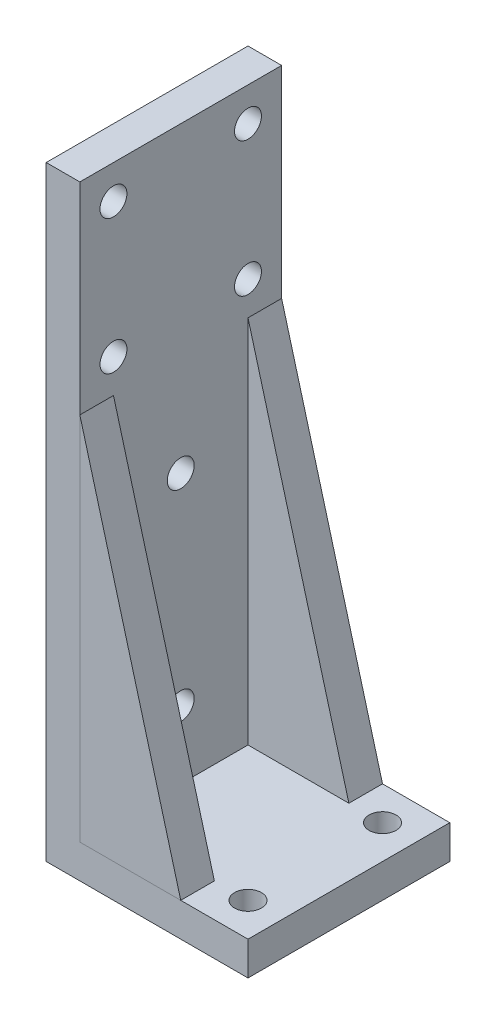
ISO-10303-21;
HEADER;
FILE_DESCRIPTION(('STEP AP214'),'2;1');
FILE_NAME('part.step','',(''),(''),'','','');
FILE_SCHEMA(('AUTOMOTIVE_DESIGN { 1 0 10303 214 1 1 1 1 }'));
ENDSEC;
DATA;
#1=APPLICATION_CONTEXT('core data for automotive mechanical design processes');
#2=APPLICATION_PROTOCOL_DEFINITION('international standard','automotive_design',2000,#1);
#3=PRODUCT_CONTEXT('',#1,'mechanical');
#4=PRODUCT('Part','Part','',(#3));
#5=PRODUCT_RELATED_PRODUCT_CATEGORY('part','',(#4));
#6=PRODUCT_DEFINITION_FORMATION('','',#4);
#7=PRODUCT_DEFINITION_CONTEXT('part definition',#1,'design');
#8=PRODUCT_DEFINITION('design','',#6,#7);
#9=PRODUCT_DEFINITION_SHAPE('','',#8);
#10=(LENGTH_UNIT() NAMED_UNIT(*) SI_UNIT(.MILLI.,.METRE.));
#11=(NAMED_UNIT(*) PLANE_ANGLE_UNIT() SI_UNIT($,.RADIAN.));
#12=(NAMED_UNIT(*) SI_UNIT($,.STERADIAN.) SOLID_ANGLE_UNIT());
#13=UNCERTAINTY_MEASURE_WITH_UNIT(LENGTH_MEASURE(1.E-05),#10,'distance_accuracy_value','');
#14=(GEOMETRIC_REPRESENTATION_CONTEXT(3) GLOBAL_UNCERTAINTY_ASSIGNED_CONTEXT((#13)) GLOBAL_UNIT_ASSIGNED_CONTEXT((#10,
#11,#12)) REPRESENTATION_CONTEXT('',''));
#15=CARTESIAN_POINT('',(0.,0.,0.));
#16=DIRECTION('',(0.,0.,1.));
#17=DIRECTION('',(1.,0.,0.));
#18=AXIS2_PLACEMENT_3D('',#15,#16,#17);
#19=CARTESIAN_POINT('',(5.00000000000001,5.,10.));
#20=DIRECTION('',(0.,-1.,0.));
#21=DIRECTION('',(0.,0.,-1.));
#22=AXIS2_PLACEMENT_3D('',#19,#20,#21);
#23=PLANE('',#22);
#24=DIRECTION('',(1.,0.,0.));
#25=VECTOR('',#24,1.);
#26=CARTESIAN_POINT('',(5.00000000000001,5.,15.));
#27=LINE('',#26,#25);
#28=CARTESIAN_POINT('',(-9.99999999999999,5.,15.));
#29=VERTEX_POINT('',#28);
#30=CARTESIAN_POINT('',(5.00000000000001,5.,15.));
#31=VERTEX_POINT('',#30);
#32=EDGE_CURVE('E94',#29,#31,#27,.T.);
#33=ORIENTED_EDGE('',*,*,#32,.F.);
#34=DIRECTION('',(0.,0.,1.));
#35=VECTOR('',#34,1.);
#36=CARTESIAN_POINT('',(-9.99999999999999,5.,10.));
#37=LINE('',#36,#35);
#38=CARTESIAN_POINT('',(-9.99999999999999,5.,10.));
#39=VERTEX_POINT('',#38);
#40=EDGE_CURVE('E12',#39,#29,#37,.T.);
#41=ORIENTED_EDGE('',*,*,#40,.F.);
#42=DIRECTION('',(1.,0.,0.));
#43=VECTOR('',#42,1.);
#44=CARTESIAN_POINT('',(5.00000000000001,5.,10.));
#45=LINE('',#44,#43);
#46=CARTESIAN_POINT('',(5.00000000000001,5.,10.));
#47=VERTEX_POINT('',#46);
#48=EDGE_CURVE('E86',#39,#47,#45,.T.);
#49=ORIENTED_EDGE('',*,*,#48,.T.);
#50=DIRECTION('',(0.,0.,1.));
#51=VECTOR('',#50,1.);
#52=CARTESIAN_POINT('',(5.00000000000001,5.,10.));
#53=LINE('',#52,#51);
#54=EDGE_CURVE('E45',#47,#31,#53,.T.);
#55=ORIENTED_EDGE('',*,*,#54,.T.);
#56=EDGE_LOOP('',(#33,#41,#49,#55));
#57=FACE_BOUND('',#56,.T.);
#58=ADVANCED_FACE('F42',(#57),#23,.T.);
#59=CARTESIAN_POINT('',(-9.99999999999999,5.,10.));
#60=DIRECTION('',(-1.,0.,0.));
#61=DIRECTION('',(0.,-1.,0.));
#62=AXIS2_PLACEMENT_3D('',#59,#60,#61);
#63=PLANE('',#62);
#64=DIRECTION('',(0.,-1.,0.));
#65=VECTOR('',#64,1.);
#66=CARTESIAN_POINT('',(-9.99999999999999,5.,15.));
#67=LINE('',#66,#65);
#68=CARTESIAN_POINT('',(-10.,60.,15.));
#69=VERTEX_POINT('',#68);
#70=EDGE_CURVE('E88',#69,#29,#67,.T.);
#71=ORIENTED_EDGE('',*,*,#70,.F.);
#72=DIRECTION('',(0.,0.,1.));
#73=VECTOR('',#72,1.);
#74=CARTESIAN_POINT('',(-10.,60.,10.));
#75=LINE('',#74,#73);
#76=CARTESIAN_POINT('',(-10.,60.,10.));
#77=VERTEX_POINT('',#76);
#78=EDGE_CURVE('E51',#77,#69,#75,.T.);
#79=ORIENTED_EDGE('',*,*,#78,.F.);
#80=DIRECTION('',(0.,-1.,0.));
#81=VECTOR('',#80,1.);
#82=CARTESIAN_POINT('',(-9.99999999999999,5.,10.));
#83=LINE('',#82,#81);
#84=EDGE_CURVE('E83',#77,#39,#83,.T.);
#85=ORIENTED_EDGE('',*,*,#84,.T.);
#86=ORIENTED_EDGE('',*,*,#40,.T.);
#87=EDGE_LOOP('',(#71,#79,#85,#86));
#88=FACE_BOUND('',#87,.T.);
#89=ADVANCED_FACE('F98',(#88),#63,.T.);
#90=CARTESIAN_POINT('',(-10.,60.,10.));
#91=DIRECTION('',(0.964763821237732,0.263117405792109,0.));
#92=DIRECTION('',(-0.263117405792109,0.964763821237732,0.));
#93=AXIS2_PLACEMENT_3D('',#90,#91,#92);
#94=PLANE('',#93);
#95=DIRECTION('',(-0.263117405792109,0.964763821237732,0.));
#96=VECTOR('',#95,1.);
#97=CARTESIAN_POINT('',(-10.,60.,15.));
#98=LINE('',#97,#96);
#99=EDGE_CURVE('E81',#31,#69,#98,.T.);
#100=ORIENTED_EDGE('',*,*,#99,.F.);
#101=ORIENTED_EDGE('',*,*,#54,.F.);
#102=DIRECTION('',(-0.263117405792109,0.964763821237732,0.));
#103=VECTOR('',#102,1.);
#104=CARTESIAN_POINT('',(-10.,60.,10.));
#105=LINE('',#104,#103);
#106=EDGE_CURVE('E79',#47,#77,#105,.T.);
#107=ORIENTED_EDGE('',*,*,#106,.T.);
#108=ORIENTED_EDGE('',*,*,#78,.T.);
#109=EDGE_LOOP('',(#100,#101,#107,#108));
#110=FACE_BOUND('',#109,.T.);
#111=ADVANCED_FACE('F78',(#110),#94,.T.);
#112=CARTESIAN_POINT('',(0.,0.,10.));
#113=DIRECTION('',(0.,0.,-1.));
#114=DIRECTION('',(-1.,0.,0.));
#115=AXIS2_PLACEMENT_3D('',#112,#113,#114);
#116=PLANE('',#115);
#117=ORIENTED_EDGE('',*,*,#48,.F.);
#118=ORIENTED_EDGE('',*,*,#84,.F.);
#119=ORIENTED_EDGE('',*,*,#106,.F.);
#120=EDGE_LOOP('',(#117,#118,#119));
#121=FACE_BOUND('',#120,.T.);
#122=ADVANCED_FACE('F85',(#121),#116,.T.);
#123=CARTESIAN_POINT('',(0.,0.,15.));
#124=DIRECTION('',(0.,0.,-1.));
#125=DIRECTION('',(-1.,0.,0.));
#126=AXIS2_PLACEMENT_3D('',#123,#124,#125);
#127=PLANE('',#126);
#128=ORIENTED_EDGE('',*,*,#32,.T.);
#129=ORIENTED_EDGE('',*,*,#99,.T.);
#130=ORIENTED_EDGE('',*,*,#70,.T.);
#131=EDGE_LOOP('',(#128,#129,#130));
#132=FACE_BOUND('',#131,.T.);
#133=ADVANCED_FACE('F97',(#132),#127,.F.);
#134=CLOSED_SHELL('',(#58,#89,#111,#122,#133));
#135=MANIFOLD_SOLID_BREP('B2',#134);
#136=CARTESIAN_POINT('',(0.,5.,0.));
#137=DIRECTION('',(0.,-1.,0.));
#138=DIRECTION('',(0.,0.,-1.));
#139=AXIS2_PLACEMENT_3D('',#136,#137,#138);
#140=PLANE('',#139);
#141=CARTESIAN_POINT('',(10.,5.,10.));
#142=DIRECTION('',(0.,1.,0.));
#143=DIRECTION('',(0.,0.,1.));
#144=AXIS2_PLACEMENT_3D('',#141,#142,#143);
#145=CIRCLE('',#144,2.);
#146=CARTESIAN_POINT('',(10.,5.,12.));
#147=VERTEX_POINT('',#146);
#148=EDGE_CURVE('E318',#147,#147,#145,.T.);
#149=ORIENTED_EDGE('',*,*,#148,.F.);
#150=EDGE_LOOP('',(#149));
#151=FACE_BOUND('',#150,.T.);
#152=CARTESIAN_POINT('',(10.,5.,-10.));
#153=DIRECTION('',(0.,1.,0.));
#154=DIRECTION('',(0.,0.,1.));
#155=AXIS2_PLACEMENT_3D('',#152,#153,#154);
#156=CIRCLE('',#155,2.);
#157=CARTESIAN_POINT('',(10.,5.,-8.));
#158=VERTEX_POINT('',#157);
#159=EDGE_CURVE('E312',#158,#158,#156,.T.);
#160=ORIENTED_EDGE('',*,*,#159,.F.);
#161=EDGE_LOOP('',(#160));
#162=FACE_BOUND('',#161,.T.);
#163=DIRECTION('',(0.,0.,-1.));
#164=VECTOR('',#163,1.);
#165=CARTESIAN_POINT('',(5.00000000000001,5.,-10.));
#166=LINE('',#165,#164);
#167=CARTESIAN_POINT('',(5.00000000000001,5.,-10.));
#168=VERTEX_POINT('',#167);
#169=CARTESIAN_POINT('',(5.00000000000001,5.,-15.));
#170=VERTEX_POINT('',#169);
#171=EDGE_CURVE('E239',#168,#170,#166,.T.);
#172=ORIENTED_EDGE('',*,*,#171,.F.);
#173=DIRECTION('',(1.,0.,0.));
#174=VECTOR('',#173,1.);
#175=CARTESIAN_POINT('',(5.00000000000001,5.,-10.));
#176=LINE('',#175,#174);
#177=CARTESIAN_POINT('',(-9.99999999999999,5.,-10.));
#178=VERTEX_POINT('',#177);
#179=EDGE_CURVE('E254',#178,#168,#176,.T.);
#180=ORIENTED_EDGE('',*,*,#179,.F.);
#181=DIRECTION('',(0.,0.,-1.));
#182=VECTOR('',#181,1.);
#183=CARTESIAN_POINT('',(-9.99999999999999,5.,-15.));
#184=LINE('',#183,#182);
#185=CARTESIAN_POINT('',(-9.99999999999999,5.,15.));
#186=VERTEX_POINT('',#185);
#187=EDGE_CURVE('E154',#186,#178,#184,.T.);
#188=ORIENTED_EDGE('',*,*,#187,.F.);
#189=DIRECTION('',(1.,0.,0.));
#190=VECTOR('',#189,1.);
#191=CARTESIAN_POINT('',(-15.,5.,15.));
#192=LINE('',#191,#190);
#193=CARTESIAN_POINT('',(15.,5.,15.));
#194=VERTEX_POINT('',#193);
#195=EDGE_CURVE('E159',#186,#194,#192,.T.);
#196=ORIENTED_EDGE('',*,*,#195,.T.);
#197=DIRECTION('',(0.,0.,-1.));
#198=VECTOR('',#197,1.);
#199=CARTESIAN_POINT('',(15.,5.,15.));
#200=LINE('',#199,#198);
#201=CARTESIAN_POINT('',(15.,5.,-15.));
#202=VERTEX_POINT('',#201);
#203=EDGE_CURVE('E190',#194,#202,#200,.T.);
#204=ORIENTED_EDGE('',*,*,#203,.T.);
#205=DIRECTION('',(-1.,0.,0.));
#206=VECTOR('',#205,1.);
#207=CARTESIAN_POINT('',(-15.,5.,-15.));
#208=LINE('',#207,#206);
#209=EDGE_CURVE('E241',#202,#170,#208,.T.);
#210=ORIENTED_EDGE('',*,*,#209,.T.);
#211=EDGE_LOOP('',(#172,#180,#188,#196,#204,#210));
#212=FACE_BOUND('',#211,.T.);
#213=ADVANCED_FACE('F139',(#151,#162,#212),#140,.F.);
#214=CARTESIAN_POINT('',(-9.99999999999999,90.,-15.));
#215=DIRECTION('',(-1.,0.,0.));
#216=DIRECTION('',(0.,0.,1.));
#217=AXIS2_PLACEMENT_3D('',#214,#215,#216);
#218=PLANE('',#217);
#219=CARTESIAN_POINT('',(-9.99999999999999,65.,-10.));
#220=DIRECTION('',(1.,0.,0.));
#221=DIRECTION('',(0.,0.,-1.));
#222=AXIS2_PLACEMENT_3D('',#219,#220,#221);
#223=CIRCLE('',#222,2.);
#224=CARTESIAN_POINT('',(-9.99999999999999,65.,-12.));
#225=VERTEX_POINT('',#224);
#226=EDGE_CURVE('E330',#225,#225,#223,.T.);
#227=ORIENTED_EDGE('',*,*,#226,.F.);
#228=EDGE_LOOP('',(#227));
#229=FACE_BOUND('',#228,.T.);
#230=CARTESIAN_POINT('',(-9.99999999999999,65.,10.));
#231=DIRECTION('',(1.,0.,0.));
#232=DIRECTION('',(0.,0.,-1.));
#233=AXIS2_PLACEMENT_3D('',#230,#231,#232);
#234=CIRCLE('',#233,2.);
#235=CARTESIAN_POINT('',(-9.99999999999999,65.,8.));
#236=VERTEX_POINT('',#235);
#237=EDGE_CURVE('E324',#236,#236,#234,.T.);
#238=ORIENTED_EDGE('',*,*,#237,.F.);
#239=EDGE_LOOP('',(#238));
#240=FACE_BOUND('',#239,.T.);
#241=CARTESIAN_POINT('',(-9.99999999999999,85.,-10.));
#242=DIRECTION('',(1.,0.,0.));
#243=DIRECTION('',(0.,0.,-1.));
#244=AXIS2_PLACEMENT_3D('',#241,#242,#243);
#245=CIRCLE('',#244,2.);
#246=CARTESIAN_POINT('',(-9.99999999999999,85.,-12.));
#247=VERTEX_POINT('',#246);
#248=EDGE_CURVE('E307',#247,#247,#245,.T.);
#249=ORIENTED_EDGE('',*,*,#248,.F.);
#250=EDGE_LOOP('',(#249));
#251=FACE_BOUND('',#250,.T.);
#252=CARTESIAN_POINT('',(-9.99999999999999,15.,0.));
#253=DIRECTION('',(1.,0.,0.));
#254=DIRECTION('',(0.,0.,-1.));
#255=AXIS2_PLACEMENT_3D('',#252,#253,#254);
#256=CIRCLE('',#255,2.);
#257=CARTESIAN_POINT('',(-9.99999999999999,15.,-2.));
#258=VERTEX_POINT('',#257);
#259=EDGE_CURVE('E301',#258,#258,#256,.T.);
#260=ORIENTED_EDGE('',*,*,#259,.F.);
#261=EDGE_LOOP('',(#260));
#262=FACE_BOUND('',#261,.T.);
#263=CARTESIAN_POINT('',(-9.99999999999999,45.,0.));
#264=DIRECTION('',(1.,0.,0.));
#265=DIRECTION('',(0.,0.,-1.));
#266=AXIS2_PLACEMENT_3D('',#263,#264,#265);
#267=CIRCLE('',#266,2.);
#268=CARTESIAN_POINT('',(-9.99999999999999,45.,-2.));
#269=VERTEX_POINT('',#268);
#270=EDGE_CURVE('E294',#269,#269,#267,.T.);
#271=ORIENTED_EDGE('',*,*,#270,.F.);
#272=EDGE_LOOP('',(#271));
#273=FACE_BOUND('',#272,.T.);
#274=CARTESIAN_POINT('',(-9.99999999999999,85.,10.));
#275=DIRECTION('',(1.,0.,0.));
#276=DIRECTION('',(0.,0.,-1.));
#277=AXIS2_PLACEMENT_3D('',#274,#275,#276);
#278=CIRCLE('',#277,2.);
#279=CARTESIAN_POINT('',(-9.99999999999999,85.,8.));
#280=VERTEX_POINT('',#279);
#281=EDGE_CURVE('E288',#280,#280,#278,.T.);
#282=ORIENTED_EDGE('',*,*,#281,.F.);
#283=EDGE_LOOP('',(#282));
#284=FACE_BOUND('',#283,.T.);
#285=DIRECTION('',(0.,0.,-1.));
#286=VECTOR('',#285,1.);
#287=CARTESIAN_POINT('',(-9.99999999999999,60.,-10.));
#288=LINE('',#287,#286);
#289=CARTESIAN_POINT('',(-9.99999999999999,60.,-10.));
#290=VERTEX_POINT('',#289);
#291=CARTESIAN_POINT('',(-9.99999999999999,60.,-15.));
#292=VERTEX_POINT('',#291);
#293=EDGE_CURVE('E262',#290,#292,#288,.T.);
#294=ORIENTED_EDGE('',*,*,#293,.T.);
#295=DIRECTION('',(0.,-1.,0.));
#296=VECTOR('',#295,1.);
#297=CARTESIAN_POINT('',(-9.99999999999999,90.,-15.));
#298=LINE('',#297,#296);
#299=CARTESIAN_POINT('',(-9.99999999999999,90.,-15.));
#300=VERTEX_POINT('',#299);
#301=EDGE_CURVE('E204',#300,#292,#298,.T.);
#302=ORIENTED_EDGE('',*,*,#301,.F.);
#303=DIRECTION('',(0.,0.,-1.));
#304=VECTOR('',#303,1.);
#305=CARTESIAN_POINT('',(-9.99999999999999,90.,-15.));
#306=LINE('',#305,#304);
#307=CARTESIAN_POINT('',(-9.99999999999999,90.,15.));
#308=VERTEX_POINT('',#307);
#309=EDGE_CURVE('E231',#308,#300,#306,.T.);
#310=ORIENTED_EDGE('',*,*,#309,.F.);
#311=DIRECTION('',(0.,-1.,0.));
#312=VECTOR('',#311,1.);
#313=CARTESIAN_POINT('',(-9.99999999999999,90.,15.));
#314=LINE('',#313,#312);
#315=EDGE_CURVE('E200',#308,#186,#314,.T.);
#316=ORIENTED_EDGE('',*,*,#315,.T.);
#317=ORIENTED_EDGE('',*,*,#187,.T.);
#318=DIRECTION('',(0.,-1.,0.));
#319=VECTOR('',#318,1.);
#320=CARTESIAN_POINT('',(-9.99999999999999,5.,-10.));
#321=LINE('',#320,#319);
#322=EDGE_CURVE('E264',#290,#178,#321,.T.);
#323=ORIENTED_EDGE('',*,*,#322,.F.);
#324=EDGE_LOOP('',(#294,#302,#310,#316,#317,#323));
#325=FACE_BOUND('',#324,.T.);
#326=ADVANCED_FACE('F271',(#229,#240,#251,#262,#273,#284,#325),#218,.F.);
#327=CARTESIAN_POINT('',(15.,5.,15.));
#328=DIRECTION('',(-1.,0.,0.));
#329=DIRECTION('',(0.,0.,1.));
#330=AXIS2_PLACEMENT_3D('',#327,#328,#329);
#331=PLANE('',#330);
#332=DIRECTION('',(0.,0.,-1.));
#333=VECTOR('',#332,1.);
#334=CARTESIAN_POINT('',(15.,0.,15.));
#335=LINE('',#334,#333);
#336=CARTESIAN_POINT('',(15.,0.,15.));
#337=VERTEX_POINT('',#336);
#338=CARTESIAN_POINT('',(15.,0.,-15.));
#339=VERTEX_POINT('',#338);
#340=EDGE_CURVE('E196',#337,#339,#335,.T.);
#341=ORIENTED_EDGE('',*,*,#340,.T.);
#342=DIRECTION('',(0.,-1.,0.));
#343=VECTOR('',#342,1.);
#344=CARTESIAN_POINT('',(15.,5.,-15.));
#345=LINE('',#344,#343);
#346=EDGE_CURVE('E40',#202,#339,#345,.T.);
#347=ORIENTED_EDGE('',*,*,#346,.F.);
#348=ORIENTED_EDGE('',*,*,#203,.F.);
#349=DIRECTION('',(0.,-1.,0.));
#350=VECTOR('',#349,1.);
#351=CARTESIAN_POINT('',(15.,5.,15.));
#352=LINE('',#351,#350);
#353=EDGE_CURVE('E182',#194,#337,#352,.T.);
#354=ORIENTED_EDGE('',*,*,#353,.T.);
#355=EDGE_LOOP('',(#341,#347,#348,#354));
#356=FACE_BOUND('',#355,.T.);
#357=ADVANCED_FACE('F141',(#356),#331,.F.);
#358=CARTESIAN_POINT('',(-15.,5.,-15.));
#359=DIRECTION('',(0.,0.,1.));
#360=DIRECTION('',(1.,0.,0.));
#361=AXIS2_PLACEMENT_3D('',#358,#359,#360);
#362=PLANE('',#361);
#363=DIRECTION('',(-0.263117405792109,0.964763821237732,0.));
#364=VECTOR('',#363,1.);
#365=CARTESIAN_POINT('',(-9.99999999999999,60.,-15.));
#366=LINE('',#365,#364);
#367=EDGE_CURVE('E250',#170,#292,#366,.T.);
#368=ORIENTED_EDGE('',*,*,#367,.F.);
#369=ORIENTED_EDGE('',*,*,#209,.F.);
#370=ORIENTED_EDGE('',*,*,#346,.T.);
#371=DIRECTION('',(-1.,0.,0.));
#372=VECTOR('',#371,1.);
#373=CARTESIAN_POINT('',(-15.,0.,-15.));
#374=LINE('',#373,#372);
#375=CARTESIAN_POINT('',(-15.,0.,-15.));
#376=VERTEX_POINT('',#375);
#377=EDGE_CURVE('E199',#339,#376,#374,.T.);
#378=ORIENTED_EDGE('',*,*,#377,.T.);
#379=DIRECTION('',(0.,-1.,0.));
#380=VECTOR('',#379,1.);
#381=CARTESIAN_POINT('',(-15.,5.,-15.));
#382=LINE('',#381,#380);
#383=CARTESIAN_POINT('',(-15.,90.,-15.));
#384=VERTEX_POINT('',#383);
#385=EDGE_CURVE('E147',#384,#376,#382,.T.);
#386=ORIENTED_EDGE('',*,*,#385,.F.);
#387=DIRECTION('',(-1.,0.,0.));
#388=VECTOR('',#387,1.);
#389=CARTESIAN_POINT('',(-15.,90.,-15.));
#390=LINE('',#389,#388);
#391=EDGE_CURVE('E224',#300,#384,#390,.T.);
#392=ORIENTED_EDGE('',*,*,#391,.F.);
#393=ORIENTED_EDGE('',*,*,#301,.T.);
#394=EDGE_LOOP('',(#368,#369,#370,#378,#386,#392,#393));
#395=FACE_BOUND('',#394,.T.);
#396=ADVANCED_FACE('F221',(#395),#362,.F.);
#397=CARTESIAN_POINT('',(-15.,5.,15.));
#398=DIRECTION('',(1.,0.,0.));
#399=DIRECTION('',(0.,0.,-1.));
#400=AXIS2_PLACEMENT_3D('',#397,#398,#399);
#401=PLANE('',#400);
#402=CARTESIAN_POINT('',(-15.,65.,-10.));
#403=DIRECTION('',(1.,0.,0.));
#404=DIRECTION('',(0.,0.,-1.));
#405=AXIS2_PLACEMENT_3D('',#402,#403,#404);
#406=CIRCLE('',#405,2.);
#407=CARTESIAN_POINT('',(-15.,65.,-12.));
#408=VERTEX_POINT('',#407);
#409=EDGE_CURVE('E327',#408,#408,#406,.T.);
#410=ORIENTED_EDGE('',*,*,#409,.T.);
#411=EDGE_LOOP('',(#410));
#412=FACE_BOUND('',#411,.T.);
#413=CARTESIAN_POINT('',(-15.,65.,10.));
#414=DIRECTION('',(1.,0.,0.));
#415=DIRECTION('',(0.,0.,-1.));
#416=AXIS2_PLACEMENT_3D('',#413,#414,#415);
#417=CIRCLE('',#416,2.);
#418=CARTESIAN_POINT('',(-15.,65.,8.));
#419=VERTEX_POINT('',#418);
#420=EDGE_CURVE('E321',#419,#419,#417,.T.);
#421=ORIENTED_EDGE('',*,*,#420,.T.);
#422=EDGE_LOOP('',(#421));
#423=FACE_BOUND('',#422,.T.);
#424=CARTESIAN_POINT('',(-15.,85.,-10.));
#425=DIRECTION('',(1.,0.,0.));
#426=DIRECTION('',(0.,0.,-1.));
#427=AXIS2_PLACEMENT_3D('',#424,#425,#426);
#428=CIRCLE('',#427,2.);
#429=CARTESIAN_POINT('',(-15.,85.,-12.));
#430=VERTEX_POINT('',#429);
#431=EDGE_CURVE('E291',#430,#430,#428,.T.);
#432=ORIENTED_EDGE('',*,*,#431,.T.);
#433=EDGE_LOOP('',(#432));
#434=FACE_BOUND('',#433,.T.);
#435=CARTESIAN_POINT('',(-15.,15.,0.));
#436=DIRECTION('',(1.,0.,0.));
#437=DIRECTION('',(0.,0.,-1.));
#438=AXIS2_PLACEMENT_3D('',#435,#436,#437);
#439=CIRCLE('',#438,2.);
#440=CARTESIAN_POINT('',(-15.,15.,-2.));
#441=VERTEX_POINT('',#440);
#442=EDGE_CURVE('E304',#441,#441,#439,.T.);
#443=ORIENTED_EDGE('',*,*,#442,.T.);
#444=EDGE_LOOP('',(#443));
#445=FACE_BOUND('',#444,.T.);
#446=CARTESIAN_POINT('',(-15.,45.,0.));
#447=DIRECTION('',(1.,0.,0.));
#448=DIRECTION('',(0.,0.,-1.));
#449=AXIS2_PLACEMENT_3D('',#446,#447,#448);
#450=CIRCLE('',#449,2.);
#451=CARTESIAN_POINT('',(-15.,45.,-2.));
#452=VERTEX_POINT('',#451);
#453=EDGE_CURVE('E297',#452,#452,#450,.T.);
#454=ORIENTED_EDGE('',*,*,#453,.T.);
#455=EDGE_LOOP('',(#454));
#456=FACE_BOUND('',#455,.T.);
#457=CARTESIAN_POINT('',(-15.,85.,10.));
#458=DIRECTION('',(1.,0.,0.));
#459=DIRECTION('',(0.,0.,-1.));
#460=AXIS2_PLACEMENT_3D('',#457,#458,#459);
#461=CIRCLE('',#460,2.);
#462=CARTESIAN_POINT('',(-15.,85.,8.));
#463=VERTEX_POINT('',#462);
#464=EDGE_CURVE('E255',#463,#463,#461,.T.);
#465=ORIENTED_EDGE('',*,*,#464,.T.);
#466=EDGE_LOOP('',(#465));
#467=FACE_BOUND('',#466,.T.);
#468=DIRECTION('',(0.,0.,1.));
#469=VECTOR('',#468,1.);
#470=CARTESIAN_POINT('',(-15.,0.,15.));
#471=LINE('',#470,#469);
#472=CARTESIAN_POINT('',(-15.,0.,15.));
#473=VERTEX_POINT('',#472);
#474=EDGE_CURVE('E191',#376,#473,#471,.T.);
#475=ORIENTED_EDGE('',*,*,#474,.T.);
#476=DIRECTION('',(0.,-1.,0.));
#477=VECTOR('',#476,1.);
#478=CARTESIAN_POINT('',(-15.,5.,15.));
#479=LINE('',#478,#477);
#480=CARTESIAN_POINT('',(-15.,90.,15.));
#481=VERTEX_POINT('',#480);
#482=EDGE_CURVE('E186',#481,#473,#479,.T.);
#483=ORIENTED_EDGE('',*,*,#482,.F.);
#484=DIRECTION('',(0.,0.,1.));
#485=VECTOR('',#484,1.);
#486=CARTESIAN_POINT('',(-15.,90.,-15.));
#487=LINE('',#486,#485);
#488=EDGE_CURVE('E216',#384,#481,#487,.T.);
#489=ORIENTED_EDGE('',*,*,#488,.F.);
#490=ORIENTED_EDGE('',*,*,#385,.T.);
#491=EDGE_LOOP('',(#475,#483,#489,#490));
#492=FACE_BOUND('',#491,.T.);
#493=ADVANCED_FACE('F214',(#412,#423,#434,#445,#456,#467,#492),#401,.F.);
#494=CARTESIAN_POINT('',(-15.,5.,15.));
#495=DIRECTION('',(0.,0.,-1.));
#496=DIRECTION('',(-1.,0.,0.));
#497=AXIS2_PLACEMENT_3D('',#494,#495,#496);
#498=PLANE('',#497);
#499=DIRECTION('',(1.,0.,0.));
#500=VECTOR('',#499,1.);
#501=CARTESIAN_POINT('',(-15.,0.,15.));
#502=LINE('',#501,#500);
#503=EDGE_CURVE('E179',#473,#337,#502,.T.);
#504=ORIENTED_EDGE('',*,*,#503,.T.);
#505=ORIENTED_EDGE('',*,*,#353,.F.);
#506=ORIENTED_EDGE('',*,*,#195,.F.);
#507=ORIENTED_EDGE('',*,*,#315,.F.);
#508=DIRECTION('',(1.,0.,0.));
#509=VECTOR('',#508,1.);
#510=CARTESIAN_POINT('',(-15.,90.,15.));
#511=LINE('',#510,#509);
#512=EDGE_CURVE('E235',#481,#308,#511,.T.);
#513=ORIENTED_EDGE('',*,*,#512,.F.);
#514=ORIENTED_EDGE('',*,*,#482,.T.);
#515=EDGE_LOOP('',(#504,#505,#506,#507,#513,#514));
#516=FACE_BOUND('',#515,.T.);
#517=ADVANCED_FACE('F181',(#516),#498,.F.);
#518=CARTESIAN_POINT('',(0.,0.,0.));
#519=DIRECTION('',(0.,-1.,0.));
#520=DIRECTION('',(0.,0.,-1.));
#521=AXIS2_PLACEMENT_3D('',#518,#519,#520);
#522=PLANE('',#521);
#523=CARTESIAN_POINT('',(10.,0.,10.));
#524=DIRECTION('',(0.,1.,0.));
#525=DIRECTION('',(0.,0.,1.));
#526=AXIS2_PLACEMENT_3D('',#523,#524,#525);
#527=CIRCLE('',#526,2.);
#528=CARTESIAN_POINT('',(10.,0.,12.));
#529=VERTEX_POINT('',#528);
#530=EDGE_CURVE('E315',#529,#529,#527,.T.);
#531=ORIENTED_EDGE('',*,*,#530,.T.);
#532=EDGE_LOOP('',(#531));
#533=FACE_BOUND('',#532,.T.);
#534=CARTESIAN_POINT('',(10.,0.,-10.));
#535=DIRECTION('',(0.,1.,0.));
#536=DIRECTION('',(0.,0.,1.));
#537=AXIS2_PLACEMENT_3D('',#534,#535,#536);
#538=CIRCLE('',#537,2.);
#539=CARTESIAN_POINT('',(10.,0.,-8.));
#540=VERTEX_POINT('',#539);
#541=EDGE_CURVE('E298',#540,#540,#538,.T.);
#542=ORIENTED_EDGE('',*,*,#541,.T.);
#543=EDGE_LOOP('',(#542));
#544=FACE_BOUND('',#543,.T.);
#545=ORIENTED_EDGE('',*,*,#340,.F.);
#546=ORIENTED_EDGE('',*,*,#503,.F.);
#547=ORIENTED_EDGE('',*,*,#474,.F.);
#548=ORIENTED_EDGE('',*,*,#377,.F.);
#549=EDGE_LOOP('',(#545,#546,#547,#548));
#550=FACE_BOUND('',#549,.T.);
#551=ADVANCED_FACE('F198',(#533,#544,#550),#522,.T.);
#552=CARTESIAN_POINT('',(0.,90.,0.));
#553=DIRECTION('',(0.,1.,0.));
#554=DIRECTION('',(0.,0.,1.));
#555=AXIS2_PLACEMENT_3D('',#552,#553,#554);
#556=PLANE('',#555);
#557=ORIENTED_EDGE('',*,*,#488,.T.);
#558=ORIENTED_EDGE('',*,*,#512,.T.);
#559=ORIENTED_EDGE('',*,*,#309,.T.);
#560=ORIENTED_EDGE('',*,*,#391,.T.);
#561=EDGE_LOOP('',(#557,#558,#559,#560));
#562=FACE_BOUND('',#561,.T.);
#563=ADVANCED_FACE('F227',(#562),#556,.T.);
#564=CARTESIAN_POINT('',(-9.99999999999999,60.,-10.));
#565=DIRECTION('',(-0.964763821237732,-0.263117405792109,0.));
#566=DIRECTION('',(0.263117405792109,-0.964763821237732,0.));
#567=AXIS2_PLACEMENT_3D('',#564,#565,#566);
#568=PLANE('',#567);
#569=ORIENTED_EDGE('',*,*,#367,.T.);
#570=ORIENTED_EDGE('',*,*,#293,.F.);
#571=DIRECTION('',(-0.263117405792109,0.964763821237732,0.));
#572=VECTOR('',#571,1.);
#573=CARTESIAN_POINT('',(-9.99999999999999,60.,-10.));
#574=LINE('',#573,#572);
#575=EDGE_CURVE('E260',#168,#290,#574,.T.);
#576=ORIENTED_EDGE('',*,*,#575,.F.);
#577=ORIENTED_EDGE('',*,*,#171,.T.);
#578=EDGE_LOOP('',(#569,#570,#576,#577));
#579=FACE_BOUND('',#578,.T.);
#580=ADVANCED_FACE('F258',(#579),#568,.F.);
#581=CARTESIAN_POINT('',(0.,0.,-10.));
#582=DIRECTION('',(0.,0.,-1.));
#583=DIRECTION('',(-1.,0.,0.));
#584=AXIS2_PLACEMENT_3D('',#581,#582,#583);
#585=PLANE('',#584);
#586=ORIENTED_EDGE('',*,*,#179,.T.);
#587=ORIENTED_EDGE('',*,*,#575,.T.);
#588=ORIENTED_EDGE('',*,*,#322,.T.);
#589=EDGE_LOOP('',(#586,#587,#588));
#590=FACE_BOUND('',#589,.T.);
#591=ADVANCED_FACE('F283',(#590),#585,.F.);
#592=CARTESIAN_POINT('',(-15.,85.,10.));
#593=DIRECTION('',(1.,0.,0.));
#594=DIRECTION('',(0.,0.,-1.));
#595=AXIS2_PLACEMENT_3D('',#592,#593,#594);
#596=CYLINDRICAL_SURFACE('',#595,2.);
#597=ORIENTED_EDGE('',*,*,#464,.F.);
#598=EDGE_LOOP('',(#597));
#599=FACE_BOUND('',#598,.T.);
#600=ORIENTED_EDGE('',*,*,#281,.T.);
#601=EDGE_LOOP('',(#600));
#602=FACE_BOUND('',#601,.T.);
#603=ADVANCED_FACE('F358',(#599,#602),#596,.F.);
#604=CARTESIAN_POINT('',(-15.,45.,0.));
#605=DIRECTION('',(1.,0.,0.));
#606=DIRECTION('',(0.,0.,-1.));
#607=AXIS2_PLACEMENT_3D('',#604,#605,#606);
#608=CYLINDRICAL_SURFACE('',#607,2.);
#609=ORIENTED_EDGE('',*,*,#453,.F.);
#610=EDGE_LOOP('',(#609));
#611=FACE_BOUND('',#610,.T.);
#612=ORIENTED_EDGE('',*,*,#270,.T.);
#613=EDGE_LOOP('',(#612));
#614=FACE_BOUND('',#613,.T.);
#615=ADVANCED_FACE('F360',(#611,#614),#608,.F.);
#616=CARTESIAN_POINT('',(-15.,15.,0.));
#617=DIRECTION('',(1.,0.,0.));
#618=DIRECTION('',(0.,0.,-1.));
#619=AXIS2_PLACEMENT_3D('',#616,#617,#618);
#620=CYLINDRICAL_SURFACE('',#619,2.);
#621=ORIENTED_EDGE('',*,*,#442,.F.);
#622=EDGE_LOOP('',(#621));
#623=FACE_BOUND('',#622,.T.);
#624=ORIENTED_EDGE('',*,*,#259,.T.);
#625=EDGE_LOOP('',(#624));
#626=FACE_BOUND('',#625,.T.);
#627=ADVANCED_FACE('F367',(#623,#626),#620,.F.);
#628=CARTESIAN_POINT('',(-15.,85.,-10.));
#629=DIRECTION('',(1.,0.,0.));
#630=DIRECTION('',(0.,0.,-1.));
#631=AXIS2_PLACEMENT_3D('',#628,#629,#630);
#632=CYLINDRICAL_SURFACE('',#631,2.);
#633=ORIENTED_EDGE('',*,*,#431,.F.);
#634=EDGE_LOOP('',(#633));
#635=FACE_BOUND('',#634,.T.);
#636=ORIENTED_EDGE('',*,*,#248,.T.);
#637=EDGE_LOOP('',(#636));
#638=FACE_BOUND('',#637,.T.);
#639=ADVANCED_FACE('F441',(#635,#638),#632,.F.);
#640=CARTESIAN_POINT('',(10.,0.,-10.));
#641=DIRECTION('',(0.,1.,0.));
#642=DIRECTION('',(0.,0.,1.));
#643=AXIS2_PLACEMENT_3D('',#640,#641,#642);
#644=CYLINDRICAL_SURFACE('',#643,2.);
#645=ORIENTED_EDGE('',*,*,#541,.F.);
#646=EDGE_LOOP('',(#645));
#647=FACE_BOUND('',#646,.T.);
#648=ORIENTED_EDGE('',*,*,#159,.T.);
#649=EDGE_LOOP('',(#648));
#650=FACE_BOUND('',#649,.T.);
#651=ADVANCED_FACE('F436',(#647,#650),#644,.F.);
#652=CARTESIAN_POINT('',(10.,0.,10.));
#653=DIRECTION('',(0.,1.,0.));
#654=DIRECTION('',(0.,0.,1.));
#655=AXIS2_PLACEMENT_3D('',#652,#653,#654);
#656=CYLINDRICAL_SURFACE('',#655,2.);
#657=ORIENTED_EDGE('',*,*,#530,.F.);
#658=EDGE_LOOP('',(#657));
#659=FACE_BOUND('',#658,.T.);
#660=ORIENTED_EDGE('',*,*,#148,.T.);
#661=EDGE_LOOP('',(#660));
#662=FACE_BOUND('',#661,.T.);
#663=ADVANCED_FACE('F406',(#659,#662),#656,.F.);
#664=CARTESIAN_POINT('',(-15.,65.,10.));
#665=DIRECTION('',(1.,0.,0.));
#666=DIRECTION('',(0.,0.,-1.));
#667=AXIS2_PLACEMENT_3D('',#664,#665,#666);
#668=CYLINDRICAL_SURFACE('',#667,2.);
#669=ORIENTED_EDGE('',*,*,#420,.F.);
#670=EDGE_LOOP('',(#669));
#671=FACE_BOUND('',#670,.T.);
#672=ORIENTED_EDGE('',*,*,#237,.T.);
#673=EDGE_LOOP('',(#672));
#674=FACE_BOUND('',#673,.T.);
#675=ADVANCED_FACE('F341',(#671,#674),#668,.F.);
#676=CARTESIAN_POINT('',(-15.,65.,-10.));
#677=DIRECTION('',(1.,0.,0.));
#678=DIRECTION('',(0.,0.,-1.));
#679=AXIS2_PLACEMENT_3D('',#676,#677,#678);
#680=CYLINDRICAL_SURFACE('',#679,2.);
#681=ORIENTED_EDGE('',*,*,#409,.F.);
#682=EDGE_LOOP('',(#681));
#683=FACE_BOUND('',#682,.T.);
#684=ORIENTED_EDGE('',*,*,#226,.T.);
#685=EDGE_LOOP('',(#684));
#686=FACE_BOUND('',#685,.T.);
#687=ADVANCED_FACE('F338',(#683,#686),#680,.F.);
#688=CLOSED_SHELL('',(#213,#326,#357,#396,#493,#517,#551,#563,#580,#591,#603,#615,#627,#639,
#651,#663,#675,#687));
#689=MANIFOLD_SOLID_BREP('B6',#688);
#690=ADVANCED_BREP_SHAPE_REPRESENTATION('',(#18,#135,#689),#14);
#691=SHAPE_DEFINITION_REPRESENTATION(#9,#690);
ENDSEC;
END-ISO-10303-21;
